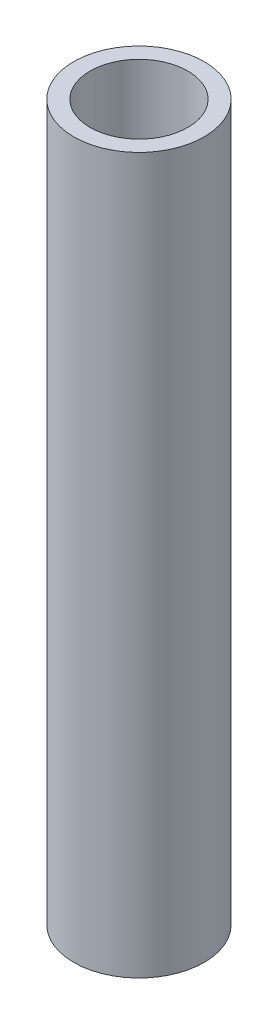
ISO-10303-21;
HEADER;
FILE_DESCRIPTION(('STEP AP214'),'2;1');
FILE_NAME('part.step','',(''),(''),'','','');
FILE_SCHEMA(('AUTOMOTIVE_DESIGN { 1 0 10303 214 1 1 1 1 }'));
ENDSEC;
DATA;
#1=APPLICATION_CONTEXT('core data for automotive mechanical design processes');
#2=APPLICATION_PROTOCOL_DEFINITION('international standard','automotive_design',2000,#1);
#3=PRODUCT_CONTEXT('',#1,'mechanical');
#4=PRODUCT('Part','Part','',(#3));
#5=PRODUCT_RELATED_PRODUCT_CATEGORY('part','',(#4));
#6=PRODUCT_DEFINITION_FORMATION('','',#4);
#7=PRODUCT_DEFINITION_CONTEXT('part definition',#1,'design');
#8=PRODUCT_DEFINITION('design','',#6,#7);
#9=PRODUCT_DEFINITION_SHAPE('','',#8);
#10=(LENGTH_UNIT() NAMED_UNIT(*) SI_UNIT(.MILLI.,.METRE.));
#11=(NAMED_UNIT(*) PLANE_ANGLE_UNIT() SI_UNIT($,.RADIAN.));
#12=(NAMED_UNIT(*) SI_UNIT($,.STERADIAN.) SOLID_ANGLE_UNIT());
#13=UNCERTAINTY_MEASURE_WITH_UNIT(LENGTH_MEASURE(1.E-05),#10,'distance_accuracy_value','');
#14=(GEOMETRIC_REPRESENTATION_CONTEXT(3) GLOBAL_UNCERTAINTY_ASSIGNED_CONTEXT((#13)) GLOBAL_UNIT_ASSIGNED_CONTEXT((#10,
#11,#12)) REPRESENTATION_CONTEXT('',''));
#15=CARTESIAN_POINT('',(0.,0.,0.));
#16=DIRECTION('',(0.,0.,1.));
#17=DIRECTION('',(1.,0.,0.));
#18=AXIS2_PLACEMENT_3D('',#15,#16,#17);
#19=CARTESIAN_POINT('',(0.,65.8,0.));
#20=DIRECTION('',(0.,1.,0.));
#21=DIRECTION('',(0.,0.,1.));
#22=AXIS2_PLACEMENT_3D('',#19,#20,#21);
#23=PLANE('',#22);
#24=CARTESIAN_POINT('',(0.,65.8,0.));
#25=DIRECTION('',(0.,1.,0.));
#26=DIRECTION('',(0.,0.,1.));
#27=AXIS2_PLACEMENT_3D('',#24,#25,#26);
#28=CIRCLE('',#27,6.);
#29=CARTESIAN_POINT('',(0.,65.8,6.));
#30=VERTEX_POINT('',#29);
#31=EDGE_CURVE('E10',#30,#30,#28,.T.);
#32=ORIENTED_EDGE('',*,*,#31,.T.);
#33=EDGE_LOOP('',(#32));
#34=FACE_BOUND('',#33,.T.);
#35=CARTESIAN_POINT('',(0.,65.8,0.));
#36=DIRECTION('',(0.,1.,0.));
#37=DIRECTION('',(0.,0.,1.));
#38=AXIS2_PLACEMENT_3D('',#35,#36,#37);
#39=CIRCLE('',#38,4.5);
#40=CARTESIAN_POINT('',(0.,65.8,4.5));
#41=VERTEX_POINT('',#40);
#42=EDGE_CURVE('E45',#41,#41,#39,.T.);
#43=ORIENTED_EDGE('',*,*,#42,.F.);
#44=EDGE_LOOP('',(#43));
#45=FACE_BOUND('',#44,.T.);
#46=ADVANCED_FACE('F34',(#34,#45),#23,.T.);
#47=CARTESIAN_POINT('',(0.,0.,0.));
#48=DIRECTION('',(0.,1.,0.));
#49=DIRECTION('',(0.,0.,1.));
#50=AXIS2_PLACEMENT_3D('',#47,#48,#49);
#51=PLANE('',#50);
#52=CARTESIAN_POINT('',(0.,0.,0.));
#53=DIRECTION('',(0.,1.,0.));
#54=DIRECTION('',(0.,0.,1.));
#55=AXIS2_PLACEMENT_3D('',#52,#53,#54);
#56=CIRCLE('',#55,6.);
#57=CARTESIAN_POINT('',(0.,0.,6.));
#58=VERTEX_POINT('',#57);
#59=EDGE_CURVE('E38',#58,#58,#56,.T.);
#60=ORIENTED_EDGE('',*,*,#59,.F.);
#61=EDGE_LOOP('',(#60));
#62=FACE_BOUND('',#61,.T.);
#63=CARTESIAN_POINT('',(0.,0.,0.));
#64=DIRECTION('',(0.,1.,0.));
#65=DIRECTION('',(0.,0.,1.));
#66=AXIS2_PLACEMENT_3D('',#63,#64,#65);
#67=CIRCLE('',#66,4.5);
#68=CARTESIAN_POINT('',(0.,0.,4.5));
#69=VERTEX_POINT('',#68);
#70=EDGE_CURVE('E47',#69,#69,#67,.T.);
#71=ORIENTED_EDGE('',*,*,#70,.T.);
#72=EDGE_LOOP('',(#71));
#73=FACE_BOUND('',#72,.T.);
#74=ADVANCED_FACE('F57',(#62,#73),#51,.F.);
#75=CARTESIAN_POINT('',(0.,65.8,0.));
#76=DIRECTION('',(0.,-1.,0.));
#77=DIRECTION('',(0.,0.,-1.));
#78=AXIS2_PLACEMENT_3D('',#75,#76,#77);
#79=CYLINDRICAL_SURFACE('',#78,6.);
#80=ORIENTED_EDGE('',*,*,#31,.F.);
#81=EDGE_LOOP('',(#80));
#82=FACE_BOUND('',#81,.T.);
#83=ORIENTED_EDGE('',*,*,#59,.T.);
#84=EDGE_LOOP('',(#83));
#85=FACE_BOUND('',#84,.T.);
#86=ADVANCED_FACE('F36',(#82,#85),#79,.T.);
#87=CARTESIAN_POINT('',(0.,65.8,0.));
#88=DIRECTION('',(0.,-1.,0.));
#89=DIRECTION('',(0.,0.,-1.));
#90=AXIS2_PLACEMENT_3D('',#87,#88,#89);
#91=CYLINDRICAL_SURFACE('',#90,4.5);
#92=ORIENTED_EDGE('',*,*,#42,.T.);
#93=EDGE_LOOP('',(#92));
#94=FACE_BOUND('',#93,.T.);
#95=ORIENTED_EDGE('',*,*,#70,.F.);
#96=EDGE_LOOP('',(#95));
#97=FACE_BOUND('',#96,.T.);
#98=ADVANCED_FACE('F53',(#94,#97),#91,.F.);
#99=CLOSED_SHELL('',(#46,#74,#86,#98));
#100=MANIFOLD_SOLID_BREP('B2',#99);
#101=ADVANCED_BREP_SHAPE_REPRESENTATION('',(#18,#100),#14);
#102=SHAPE_DEFINITION_REPRESENTATION(#9,#101);
ENDSEC;
END-ISO-10303-21;
